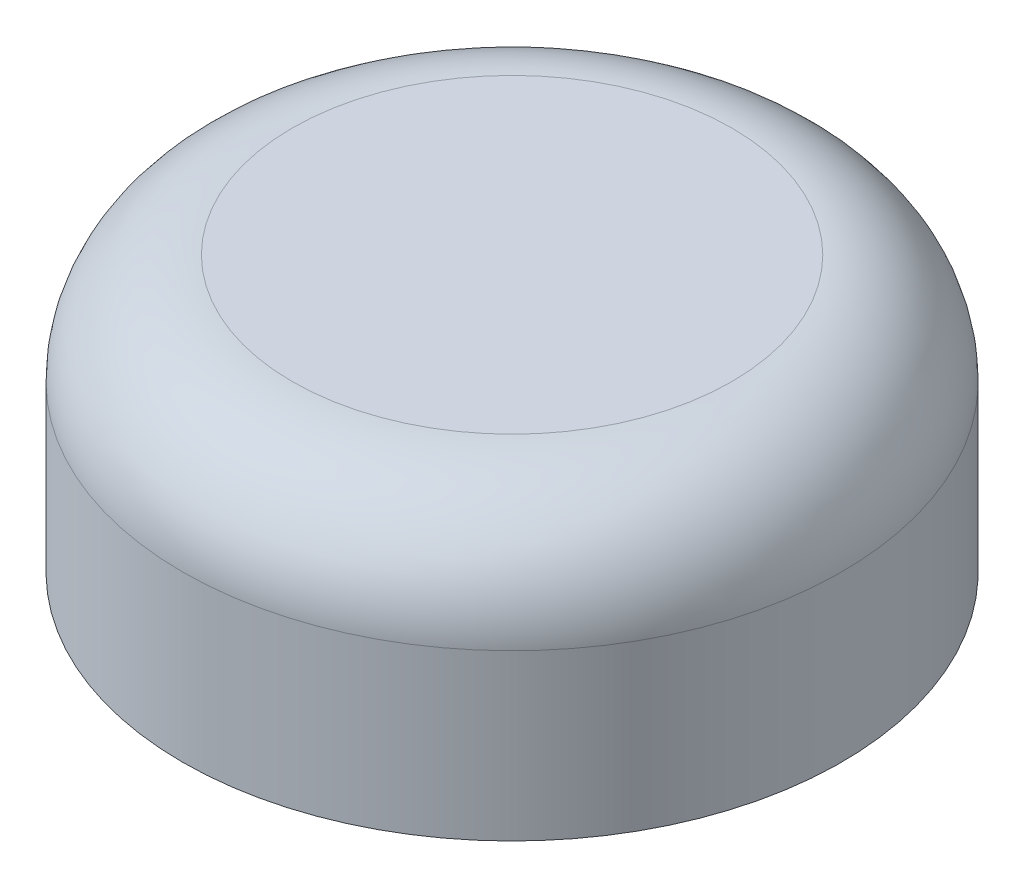
ISO-10303-21;
HEADER;
FILE_DESCRIPTION(('STEP AP214'),'2;1');
FILE_NAME('part.step','',(''),(''),'','','');
FILE_SCHEMA(('AUTOMOTIVE_DESIGN { 1 0 10303 214 1 1 1 1 }'));
ENDSEC;
DATA;
#1=APPLICATION_CONTEXT('core data for automotive mechanical design processes');
#2=APPLICATION_PROTOCOL_DEFINITION('international standard','automotive_design',2000,#1);
#3=PRODUCT_CONTEXT('',#1,'mechanical');
#4=PRODUCT('Part','Part','',(#3));
#5=PRODUCT_RELATED_PRODUCT_CATEGORY('part','',(#4));
#6=PRODUCT_DEFINITION_FORMATION('','',#4);
#7=PRODUCT_DEFINITION_CONTEXT('part definition',#1,'design');
#8=PRODUCT_DEFINITION('design','',#6,#7);
#9=PRODUCT_DEFINITION_SHAPE('','',#8);
#10=(LENGTH_UNIT() NAMED_UNIT(*) SI_UNIT(.MILLI.,.METRE.));
#11=(NAMED_UNIT(*) PLANE_ANGLE_UNIT() SI_UNIT($,.RADIAN.));
#12=(NAMED_UNIT(*) SI_UNIT($,.STERADIAN.) SOLID_ANGLE_UNIT());
#13=UNCERTAINTY_MEASURE_WITH_UNIT(LENGTH_MEASURE(1.E-05),#10,'distance_accuracy_value','');
#14=(GEOMETRIC_REPRESENTATION_CONTEXT(3) GLOBAL_UNCERTAINTY_ASSIGNED_CONTEXT((#13)) GLOBAL_UNIT_ASSIGNED_CONTEXT((#10,
#11,#12)) REPRESENTATION_CONTEXT('',''));
#15=CARTESIAN_POINT('',(0.,0.,0.));
#16=DIRECTION('',(0.,0.,1.));
#17=DIRECTION('',(1.,0.,0.));
#18=AXIS2_PLACEMENT_3D('',#15,#16,#17);
#19=CARTESIAN_POINT('',(-0.47756077679837,0.,0.));
#20=DIRECTION('',(0.,1.,0.));
#21=DIRECTION('',(0.,0.,1.));
#22=AXIS2_PLACEMENT_3D('',#19,#20,#21);
#23=PLANE('',#22);
#24=CARTESIAN_POINT('',(-0.47756077679837,0.,0.));
#25=DIRECTION('',(0.,1.,0.));
#26=DIRECTION('',(0.,0.,1.));
#27=AXIS2_PLACEMENT_3D('',#24,#25,#26);
#28=CIRCLE('',#27,6.);
#29=CARTESIAN_POINT('',(-0.47756077679837,0.,6.));
#30=VERTEX_POINT('',#29);
#31=EDGE_CURVE('E42',#30,#30,#28,.T.);
#32=ORIENTED_EDGE('',*,*,#31,.F.);
#33=EDGE_LOOP('',(#32));
#34=FACE_BOUND('',#33,.T.);
#35=CARTESIAN_POINT('',(-0.47756077679837,0.,0.));
#36=DIRECTION('',(0.,1.,0.));
#37=DIRECTION('',(0.,0.,1.));
#38=AXIS2_PLACEMENT_3D('',#35,#36,#37);
#39=CIRCLE('',#38,5.);
#40=CARTESIAN_POINT('',(-0.47756077679837,0.,5.));
#41=VERTEX_POINT('',#40);
#42=EDGE_CURVE('E46',#41,#41,#39,.T.);
#43=ORIENTED_EDGE('',*,*,#42,.T.);
#44=EDGE_LOOP('',(#43));
#45=FACE_BOUND('',#44,.T.);
#46=ADVANCED_FACE('F31',(#34,#45),#23,.F.);
#47=CARTESIAN_POINT('',(-0.47756077679837,3.,0.));
#48=DIRECTION('',(0.,-1.,0.));
#49=DIRECTION('',(0.,0.,-1.));
#50=AXIS2_PLACEMENT_3D('',#47,#48,#49);
#51=CYLINDRICAL_SURFACE('',#50,6.);
#52=CARTESIAN_POINT('',(-0.47756077679837,3.,0.));
#53=DIRECTION('',(0.,1.,0.));
#54=DIRECTION('',(0.,0.,1.));
#55=AXIS2_PLACEMENT_3D('',#52,#53,#54);
#56=CIRCLE('',#55,6.);
#57=CARTESIAN_POINT('',(-0.47756077679837,3.,6.));
#58=VERTEX_POINT('',#57);
#59=EDGE_CURVE('E10',#58,#58,#56,.F.);
#60=ORIENTED_EDGE('',*,*,#59,.T.);
#61=EDGE_LOOP('',(#60));
#62=FACE_BOUND('',#61,.T.);
#63=ORIENTED_EDGE('',*,*,#31,.T.);
#64=EDGE_LOOP('',(#63));
#65=FACE_BOUND('',#64,.T.);
#66=ADVANCED_FACE('F67',(#62,#65),#51,.T.);
#67=CARTESIAN_POINT('',(-0.47756077679837,3.,0.));
#68=DIRECTION('',(0.,-1.,0.));
#69=DIRECTION('',(0.,0.,-1.));
#70=AXIS2_PLACEMENT_3D('',#67,#68,#69);
#71=CYLINDRICAL_SURFACE('',#70,5.);
#72=CARTESIAN_POINT('',(-0.47756077679837,3.,0.));
#73=DIRECTION('',(0.,1.,0.));
#74=DIRECTION('',(0.,0.,1.));
#75=AXIS2_PLACEMENT_3D('',#72,#73,#74);
#76=CIRCLE('',#75,5.);
#77=CARTESIAN_POINT('',(-0.47756077679837,3.,5.));
#78=VERTEX_POINT('',#77);
#79=EDGE_CURVE('E51',#78,#78,#76,.T.);
#80=ORIENTED_EDGE('',*,*,#79,.T.);
#81=EDGE_LOOP('',(#80));
#82=FACE_BOUND('',#81,.T.);
#83=ORIENTED_EDGE('',*,*,#42,.F.);
#84=EDGE_LOOP('',(#83));
#85=FACE_BOUND('',#84,.T.);
#86=ADVANCED_FACE('F55',(#82,#85),#71,.F.);
#87=CARTESIAN_POINT('',(-0.47756077679837,3.,0.));
#88=DIRECTION('',(0.,1.,0.));
#89=DIRECTION('',(0.,0.,1.));
#90=AXIS2_PLACEMENT_3D('',#87,#88,#89);
#91=PLANE('',#90);
#92=ORIENTED_EDGE('',*,*,#79,.F.);
#93=EDGE_LOOP('',(#92));
#94=FACE_BOUND('',#93,.T.);
#95=ADVANCED_FACE('F58',(#94),#91,.F.);
#96=CARTESIAN_POINT('',(-0.47756077679837,5.,0.));
#97=DIRECTION('',(0.,1.,0.));
#98=DIRECTION('',(0.,0.,1.));
#99=AXIS2_PLACEMENT_3D('',#96,#97,#98);
#100=PLANE('',#99);
#101=CARTESIAN_POINT('',(-0.47756077679837,5.,0.));
#102=DIRECTION('',(0.,1.,0.));
#103=DIRECTION('',(0.,0.,1.));
#104=AXIS2_PLACEMENT_3D('',#101,#102,#103);
#105=CIRCLE('',#104,4.);
#106=CARTESIAN_POINT('',(-0.47756077679837,5.,4.));
#107=VERTEX_POINT('',#106);
#108=EDGE_CURVE('E38',#107,#107,#105,.T.);
#109=ORIENTED_EDGE('',*,*,#108,.T.);
#110=EDGE_LOOP('',(#109));
#111=FACE_BOUND('',#110,.T.);
#112=ADVANCED_FACE('F60',(#111),#100,.T.);
#113=CARTESIAN_POINT('',(-0.47756077679837,3.,0.));
#114=DIRECTION('',(0.,1.,0.));
#115=DIRECTION('',(0.,0.,1.));
#116=AXIS2_PLACEMENT_3D('',#113,#114,#115);
#117=TOROIDAL_SURFACE('',#116,4.,2.);
#118=ORIENTED_EDGE('',*,*,#59,.F.);
#119=EDGE_LOOP('',(#118));
#120=FACE_BOUND('',#119,.T.);
#121=ORIENTED_EDGE('',*,*,#108,.F.);
#122=EDGE_LOOP('',(#121));
#123=FACE_BOUND('',#122,.T.);
#124=ADVANCED_FACE('F33',(#120,#123),#117,.T.);
#125=CLOSED_SHELL('',(#46,#66,#86,#95,#112,#124));
#126=MANIFOLD_SOLID_BREP('B2',#125);
#127=ADVANCED_BREP_SHAPE_REPRESENTATION('',(#18,#126),#14);
#128=SHAPE_DEFINITION_REPRESENTATION(#9,#127);
ENDSEC;
END-ISO-10303-21;
